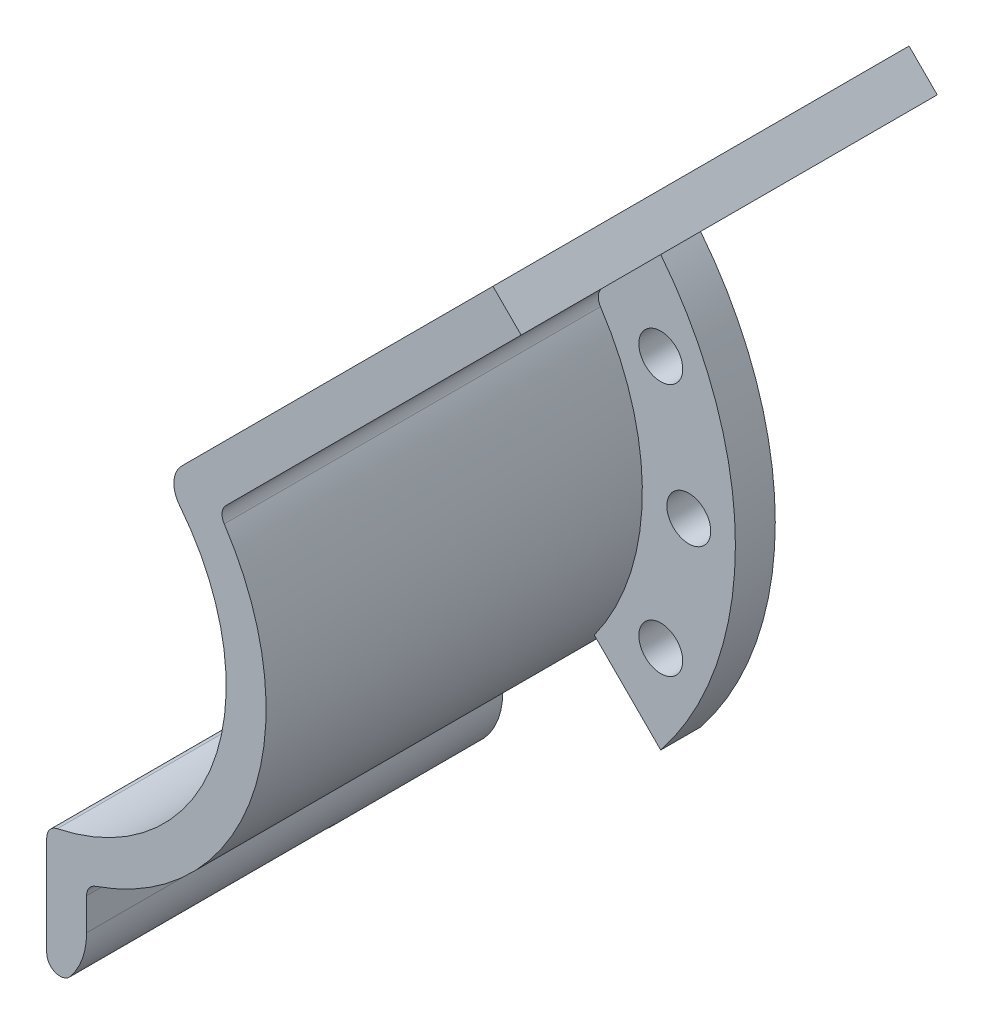
ISO-10303-21;
HEADER;
FILE_DESCRIPTION(('STEP AP214'),'2;1');
FILE_NAME('part.step','',(''),(''),'','','');
FILE_SCHEMA(('AUTOMOTIVE_DESIGN { 1 0 10303 214 1 1 1 1 }'));
ENDSEC;
DATA;
#1=APPLICATION_CONTEXT('core data for automotive mechanical design processes');
#2=APPLICATION_PROTOCOL_DEFINITION('international standard','automotive_design',2000,#1);
#3=PRODUCT_CONTEXT('',#1,'mechanical');
#4=PRODUCT('Part','Part','',(#3));
#5=PRODUCT_RELATED_PRODUCT_CATEGORY('part','',(#4));
#6=PRODUCT_DEFINITION_FORMATION('','',#4);
#7=PRODUCT_DEFINITION_CONTEXT('part definition',#1,'design');
#8=PRODUCT_DEFINITION('design','',#6,#7);
#9=PRODUCT_DEFINITION_SHAPE('','',#8);
#10=(LENGTH_UNIT() NAMED_UNIT(*) SI_UNIT(.MILLI.,.METRE.));
#11=(NAMED_UNIT(*) PLANE_ANGLE_UNIT() SI_UNIT($,.RADIAN.));
#12=(NAMED_UNIT(*) SI_UNIT($,.STERADIAN.) SOLID_ANGLE_UNIT());
#13=UNCERTAINTY_MEASURE_WITH_UNIT(LENGTH_MEASURE(1.E-05),#10,'distance_accuracy_value','');
#14=(GEOMETRIC_REPRESENTATION_CONTEXT(3) GLOBAL_UNCERTAINTY_ASSIGNED_CONTEXT((#13)) GLOBAL_UNIT_ASSIGNED_CONTEXT((#10,
#11,#12)) REPRESENTATION_CONTEXT('',''));
#15=CARTESIAN_POINT('',(0.,0.,0.));
#16=DIRECTION('',(0.,0.,1.));
#17=DIRECTION('',(1.,0.,0.));
#18=AXIS2_PLACEMENT_3D('',#15,#16,#17);
#19=CARTESIAN_POINT('',(0.,-21.3348082018374,40.2490319383578));
#20=DIRECTION('',(0.,0.,-1.));
#21=DIRECTION('',(-1.,0.,0.));
#22=AXIS2_PLACEMENT_3D('',#19,#20,#21);
#23=CYLINDRICAL_SURFACE('',#22,2.49999999999986);
#24=CARTESIAN_POINT('',(0.,-21.3348082018374,10.));
#25=DIRECTION('',(0.,0.,1.));
#26=DIRECTION('',(1.,0.,0.));
#27=AXIS2_PLACEMENT_3D('',#24,#25,#26);
#28=CIRCLE('',#27,2.49999999999986);
#29=CARTESIAN_POINT('',(2.49999999999986,-21.3348082018374,10.));
#30=VERTEX_POINT('',#29);
#31=CARTESIAN_POINT('',(0.,-23.8348082018372,10.));
#32=VERTEX_POINT('',#31);
#33=EDGE_CURVE('E165',#30,#32,#28,.F.);
#34=ORIENTED_EDGE('',*,*,#33,.F.);
#35=DIRECTION('',(0.,0.,-1.));
#36=VECTOR('',#35,1.);
#37=CARTESIAN_POINT('',(2.49999999999986,-21.3348082018374,40.2490319383578));
#38=LINE('',#37,#36);
#39=CARTESIAN_POINT('',(2.49999999999986,-21.3348082018374,-1.3));
#40=VERTEX_POINT('',#39);
#41=EDGE_CURVE('E179',#30,#40,#38,.T.);
#42=ORIENTED_EDGE('',*,*,#41,.T.);
#43=CARTESIAN_POINT('',(0.,-21.3348082018374,-1.3));
#44=DIRECTION('',(0.,0.,-1.));
#45=DIRECTION('',(-1.,0.,0.));
#46=AXIS2_PLACEMENT_3D('',#43,#44,#45);
#47=CIRCLE('',#46,2.49999999999986);
#48=CARTESIAN_POINT('',(0.,-23.8348082018372,-1.3));
#49=VERTEX_POINT('',#48);
#50=EDGE_CURVE('E187',#40,#49,#47,.T.);
#51=ORIENTED_EDGE('',*,*,#50,.T.);
#52=DIRECTION('',(0.,0.,-1.));
#53=VECTOR('',#52,1.);
#54=CARTESIAN_POINT('',(0.,-23.8348082018372,40.2490319383578));
#55=LINE('',#54,#53);
#56=EDGE_CURVE('E181',#32,#49,#55,.T.);
#57=ORIENTED_EDGE('',*,*,#56,.F.);
#58=EDGE_LOOP('',(#34,#42,#51,#57));
#59=FACE_BOUND('',#58,.T.);
#60=ADVANCED_FACE('F33',(#59),#23,.F.);
#61=CARTESIAN_POINT('',(0.,-23.8348082018372,40.2490319383578));
#62=DIRECTION('',(1.,0.,0.));
#63=DIRECTION('',(0.,1.,0.));
#64=AXIS2_PLACEMENT_3D('',#61,#62,#63);
#65=PLANE('',#64);
#66=DIRECTION('',(0.,-1.,0.));
#67=VECTOR('',#66,1.);
#68=CARTESIAN_POINT('',(0.,-23.8348082018372,10.));
#69=LINE('',#68,#67);
#70=CARTESIAN_POINT('',(0.,-26.8348082018372,10.));
#71=VERTEX_POINT('',#70);
#72=EDGE_CURVE('E172',#32,#71,#69,.T.);
#73=ORIENTED_EDGE('',*,*,#72,.F.);
#74=ORIENTED_EDGE('',*,*,#56,.T.);
#75=DIRECTION('',(0.,-1.,0.));
#76=VECTOR('',#75,1.);
#77=CARTESIAN_POINT('',(0.,-23.8348082018372,-1.3));
#78=LINE('',#77,#76);
#79=CARTESIAN_POINT('',(0.,-26.8348082018372,-1.3));
#80=VERTEX_POINT('',#79);
#81=EDGE_CURVE('E195',#49,#80,#78,.T.);
#82=ORIENTED_EDGE('',*,*,#81,.T.);
#83=DIRECTION('',(0.,0.,-1.));
#84=VECTOR('',#83,1.);
#85=CARTESIAN_POINT('',(0.,-26.8348082018372,40.2490319383578));
#86=LINE('',#85,#84);
#87=EDGE_CURVE('E196',#71,#80,#86,.T.);
#88=ORIENTED_EDGE('',*,*,#87,.F.);
#89=EDGE_LOOP('',(#73,#74,#82,#88));
#90=FACE_BOUND('',#89,.T.);
#91=ADVANCED_FACE('F403',(#90),#65,.F.);
#92=CARTESIAN_POINT('',(0.,0.,95.4754890815647));
#93=DIRECTION('',(0.,0.,-1.));
#94=DIRECTION('',(-1.,0.,0.));
#95=AXIS2_PLACEMENT_3D('',#92,#93,#94);
#96=CYLINDRICAL_SURFACE('',#95,19.);
#97=CARTESIAN_POINT('',(0.,0.,30.));
#98=DIRECTION('',(0.,0.,1.));
#99=DIRECTION('',(1.,0.,0.));
#100=AXIS2_PLACEMENT_3D('',#97,#98,#99);
#101=CIRCLE('',#100,19.);
#102=CARTESIAN_POINT('',(6.17499999999986,-17.9685663034089,30.));
#103=VERTEX_POINT('',#102);
#104=CARTESIAN_POINT('',(15.8505919060323,10.4765803690146,30.));
#105=VERTEX_POINT('',#104);
#106=EDGE_CURVE('E241',#103,#105,#101,.T.);
#107=ORIENTED_EDGE('',*,*,#106,.F.);
#108=DIRECTION('',(0.,0.,-1.));
#109=VECTOR('',#108,1.);
#110=CARTESIAN_POINT('',(6.17499999999986,-17.9685663034089,95.4754890815647));
#111=LINE('',#110,#109);
#112=CARTESIAN_POINT('',(6.17499999999986,-17.9685663034089,-1.3));
#113=VERTEX_POINT('',#112);
#114=EDGE_CURVE('E273',#103,#113,#111,.T.);
#115=ORIENTED_EDGE('',*,*,#114,.T.);
#116=CARTESIAN_POINT('',(0.,0.,-1.3));
#117=DIRECTION('',(0.,0.,1.));
#118=DIRECTION('',(1.,0.,0.));
#119=AXIS2_PLACEMENT_3D('',#116,#117,#118);
#120=CIRCLE('',#119,19.);
#121=CARTESIAN_POINT('',(15.3878195049812,-11.145178817862,-1.3));
#122=VERTEX_POINT('',#121);
#123=EDGE_CURVE('E230',#113,#122,#120,.T.);
#124=ORIENTED_EDGE('',*,*,#123,.T.);
#125=DIRECTION('',(0.,0.,-1.));
#126=VECTOR('',#125,1.);
#127=CARTESIAN_POINT('',(15.3878195049812,-11.145178817862,1.7));
#128=LINE('',#127,#126);
#129=CARTESIAN_POINT('',(15.3878195049812,-11.145178817862,1.70000000000001));
#130=VERTEX_POINT('',#129);
#131=EDGE_CURVE('E221',#130,#122,#128,.T.);
#132=ORIENTED_EDGE('',*,*,#131,.F.);
#133=CARTESIAN_POINT('',(0.,0.,1.7));
#134=DIRECTION('',(0.,0.,-1.));
#135=DIRECTION('',(1.,0.,0.));
#136=AXIS2_PLACEMENT_3D('',#133,#134,#135);
#137=CIRCLE('',#136,19.);
#138=CARTESIAN_POINT('',(15.8505919060323,10.4765803690146,1.7));
#139=VERTEX_POINT('',#138);
#140=EDGE_CURVE('E209',#139,#130,#137,.T.);
#141=ORIENTED_EDGE('',*,*,#140,.F.);
#142=DIRECTION('',(0.,0.,-1.));
#143=VECTOR('',#142,1.);
#144=CARTESIAN_POINT('',(15.8505919060323,10.4765803690146,95.4754890815647));
#145=LINE('',#144,#143);
#146=EDGE_CURVE('E271',#139,#105,#145,.F.);
#147=ORIENTED_EDGE('',*,*,#146,.T.);
#148=EDGE_LOOP('',(#107,#115,#124,#132,#141,#147));
#149=FACE_BOUND('',#148,.T.);
#150=ADVANCED_FACE('F377',(#149),#96,.T.);
#151=CARTESIAN_POINT('',(38.1837661840735,33.9411254969544,95.4754890815647));
#152=DIRECTION('',(-0.707106781186549,0.707106781186546,0.));
#153=DIRECTION('',(-0.707106781186546,-0.707106781186549,0.));
#154=AXIS2_PLACEMENT_3D('',#151,#152,#153);
#155=PLANE('',#154);
#156=DIRECTION('',(0.707106781186546,0.707106781186549,0.));
#157=VECTOR('',#156,1.);
#158=CARTESIAN_POINT('',(38.1837661840735,33.9411254969544,30.));
#159=LINE('',#158,#157);
#160=CARTESIAN_POINT('',(15.9777268041106,11.7350861169914,30.));
#161=VERTEX_POINT('',#160);
#162=CARTESIAN_POINT('',(38.1837661840735,33.9411254969544,30.));
#163=VERTEX_POINT('',#162);
#164=EDGE_CURVE('E229',#161,#163,#159,.T.);
#165=ORIENTED_EDGE('',*,*,#164,.F.);
#166=DIRECTION('',(0.,0.,1.));
#167=VECTOR('',#166,1.);
#168=CARTESIAN_POINT('',(15.9777268041106,11.7350861169914,1.70000000000006));
#169=LINE('',#168,#167);
#170=CARTESIAN_POINT('',(15.9777268041106,11.7350861169914,1.7));
#171=VERTEX_POINT('',#170);
#172=EDGE_CURVE('E284',#161,#171,#169,.F.);
#173=ORIENTED_EDGE('',*,*,#172,.T.);
#174=DIRECTION('',(-0.707106781186547,-0.707106781186548,0.));
#175=VECTOR('',#174,1.);
#176=CARTESIAN_POINT('',(15.3878195049812,11.145178817862,1.7));
#177=LINE('',#176,#175);
#178=CARTESIAN_POINT('',(20.3833027113093,16.1406620241901,1.70000000000001));
#179=VERTEX_POINT('',#178);
#180=EDGE_CURVE('E205',#179,#171,#177,.T.);
#181=ORIENTED_EDGE('',*,*,#180,.F.);
#182=DIRECTION('',(0.,0.,-1.));
#183=VECTOR('',#182,1.);
#184=CARTESIAN_POINT('',(20.3833027113093,16.1406620241901,1.7));
#185=LINE('',#184,#183);
#186=CARTESIAN_POINT('',(20.3833027113093,16.1406620241901,-1.3));
#187=VERTEX_POINT('',#186);
#188=EDGE_CURVE('E224',#179,#187,#185,.T.);
#189=ORIENTED_EDGE('',*,*,#188,.T.);
#190=DIRECTION('',(0.707106781186546,0.707106781186549,0.));
#191=VECTOR('',#190,1.);
#192=CARTESIAN_POINT('',(38.1837661840735,33.9411254969544,-1.3));
#193=LINE('',#192,#191);
#194=CARTESIAN_POINT('',(38.1837661840735,33.9411254969544,-1.3));
#195=VERTEX_POINT('',#194);
#196=EDGE_CURVE('E227',#187,#195,#193,.T.);
#197=ORIENTED_EDGE('',*,*,#196,.T.);
#198=DIRECTION('',(0.,0.,-1.));
#199=VECTOR('',#198,1.);
#200=CARTESIAN_POINT('',(38.1837661840735,33.9411254969544,95.4754890815647));
#201=LINE('',#200,#199);
#202=EDGE_CURVE('E226',#163,#195,#201,.T.);
#203=ORIENTED_EDGE('',*,*,#202,.F.);
#204=EDGE_LOOP('',(#165,#173,#181,#189,#197,#203));
#205=FACE_BOUND('',#204,.T.);
#206=ADVANCED_FACE('F367',(#205),#155,.F.);
#207=CARTESIAN_POINT('',(36.0624458405138,36.062445840514,95.4754890815647));
#208=DIRECTION('',(-0.707106781186544,-0.707106781186551,0.));
#209=DIRECTION('',(0.707106781186551,-0.707106781186544,0.));
#210=AXIS2_PLACEMENT_3D('',#207,#208,#209);
#211=PLANE('',#210);
#212=DIRECTION('',(-0.707106781186551,0.707106781186544,0.));
#213=VECTOR('',#212,1.);
#214=CARTESIAN_POINT('',(36.0624458405138,36.062445840514,30.));
#215=LINE('',#214,#213);
#216=CARTESIAN_POINT('',(36.0624458405138,36.062445840514,30.));
#217=VERTEX_POINT('',#216);
#218=EDGE_CURVE('E252',#163,#217,#215,.T.);
#219=ORIENTED_EDGE('',*,*,#218,.F.);
#220=ORIENTED_EDGE('',*,*,#202,.T.);
#221=DIRECTION('',(-0.707106781186551,0.707106781186544,0.));
#222=VECTOR('',#221,1.);
#223=CARTESIAN_POINT('',(36.0624458405138,36.062445840514,-1.3));
#224=LINE('',#223,#222);
#225=CARTESIAN_POINT('',(36.0624458405138,36.062445840514,-1.3));
#226=VERTEX_POINT('',#225);
#227=EDGE_CURVE('E238',#195,#226,#224,.T.);
#228=ORIENTED_EDGE('',*,*,#227,.T.);
#229=DIRECTION('',(0.,0.,-1.));
#230=VECTOR('',#229,1.);
#231=CARTESIAN_POINT('',(36.0624458405138,36.062445840514,95.4754890815647));
#232=LINE('',#231,#230);
#233=EDGE_CURVE('E237',#217,#226,#232,.T.);
#234=ORIENTED_EDGE('',*,*,#233,.F.);
#235=EDGE_LOOP('',(#219,#220,#228,#234));
#236=FACE_BOUND('',#235,.T.);
#237=ADVANCED_FACE('F449',(#236),#211,.F.);
#238=CARTESIAN_POINT('',(36.0624458405138,36.062445840514,95.4754890815647));
#239=DIRECTION('',(0.707106781186549,-0.707106781186546,0.));
#240=DIRECTION('',(0.707106781186546,0.707106781186549,0.));
#241=AXIS2_PLACEMENT_3D('',#238,#239,#240);
#242=PLANE('',#241);
#243=DIRECTION('',(-0.707106781186546,-0.707106781186549,0.));
#244=VECTOR('',#243,1.);
#245=CARTESIAN_POINT('',(36.0624458405138,36.062445840514,-1.3));
#246=LINE('',#245,#244);
#247=CARTESIAN_POINT('',(12.6491106406735,12.6491106406735,-1.3));
#248=VERTEX_POINT('',#247);
#249=EDGE_CURVE('E235',#226,#248,#246,.T.);
#250=ORIENTED_EDGE('',*,*,#249,.T.);
#251=DIRECTION('',(0.,0.,-1.));
#252=VECTOR('',#251,1.);
#253=CARTESIAN_POINT('',(12.6491106406735,12.6491106406735,95.4754890815647));
#254=LINE('',#253,#252);
#255=CARTESIAN_POINT('',(12.6491106406735,12.6491106406735,30.));
#256=VERTEX_POINT('',#255);
#257=EDGE_CURVE('E41',#248,#256,#254,.F.);
#258=ORIENTED_EDGE('',*,*,#257,.T.);
#259=DIRECTION('',(-0.707106781186546,-0.707106781186549,0.));
#260=VECTOR('',#259,1.);
#261=CARTESIAN_POINT('',(36.0624458405138,36.062445840514,30.));
#262=LINE('',#261,#260);
#263=EDGE_CURVE('E250',#217,#256,#262,.T.);
#264=ORIENTED_EDGE('',*,*,#263,.F.);
#265=ORIENTED_EDGE('',*,*,#233,.T.);
#266=EDGE_LOOP('',(#250,#258,#264,#265));
#267=FACE_BOUND('',#266,.T.);
#268=ADVANCED_FACE('F454',(#267),#242,.F.);
#269=CARTESIAN_POINT('',(0.,0.,95.4754890815647));
#270=DIRECTION('',(0.,0.,-1.));
#271=DIRECTION('',(-1.,0.,0.));
#272=AXIS2_PLACEMENT_3D('',#269,#270,#271);
#273=CYLINDRICAL_SURFACE('',#272,16.);
#274=CARTESIAN_POINT('',(0.,0.,30.));
#275=DIRECTION('',(0.,0.,1.));
#276=DIRECTION('',(1.,0.,0.));
#277=AXIS2_PLACEMENT_3D('',#274,#275,#276);
#278=CIRCLE('',#277,16.);
#279=CARTESIAN_POINT('',(12.5007326249303,9.98657518071152,30.));
#280=VERTEX_POINT('',#279);
#281=CARTESIAN_POINT('',(3.29411764705869,-15.6572280090486,30.));
#282=VERTEX_POINT('',#281);
#283=EDGE_CURVE('E248',#280,#282,#278,.F.);
#284=ORIENTED_EDGE('',*,*,#283,.F.);
#285=DIRECTION('',(0.,0.,-1.));
#286=VECTOR('',#285,1.);
#287=CARTESIAN_POINT('',(12.5007326249303,9.98657518071152,95.4754890815647));
#288=LINE('',#287,#286);
#289=CARTESIAN_POINT('',(12.5007326249303,9.98657518071152,-1.3));
#290=VERTEX_POINT('',#289);
#291=EDGE_CURVE('E296',#280,#290,#288,.T.);
#292=ORIENTED_EDGE('',*,*,#291,.T.);
#293=CARTESIAN_POINT('',(0.,0.,-1.3));
#294=DIRECTION('',(0.,0.,-1.));
#295=DIRECTION('',(1.,0.,0.));
#296=AXIS2_PLACEMENT_3D('',#293,#294,#295);
#297=CIRCLE('',#296,16.);
#298=CARTESIAN_POINT('',(3.29411764705869,-15.6572280090486,-1.3));
#299=VERTEX_POINT('',#298);
#300=EDGE_CURVE('E233',#290,#299,#297,.T.);
#301=ORIENTED_EDGE('',*,*,#300,.T.);
#302=DIRECTION('',(0.,0.,-1.));
#303=VECTOR('',#302,1.);
#304=CARTESIAN_POINT('',(3.29411764705869,-15.6572280090486,95.4754890815647));
#305=LINE('',#304,#303);
#306=EDGE_CURVE('E281',#299,#282,#305,.F.);
#307=ORIENTED_EDGE('',*,*,#306,.T.);
#308=EDGE_LOOP('',(#284,#292,#301,#307));
#309=FACE_BOUND('',#308,.T.);
#310=ADVANCED_FACE('F302',(#309),#273,.F.);
#311=CARTESIAN_POINT('',(2.49999999999986,-15.8034806292791,95.4754890815647));
#312=DIRECTION('',(1.,0.,0.));
#313=DIRECTION('',(0.,0.,-1.));
#314=AXIS2_PLACEMENT_3D('',#311,#312,#313);
#315=PLANE('',#314);
#316=DIRECTION('',(0.,1.,0.));
#317=VECTOR('',#316,1.);
#318=CARTESIAN_POINT('',(2.49999999999986,-21.3348082018374,10.));
#319=LINE('',#318,#317);
#320=CARTESIAN_POINT('',(2.49999999999986,-24.1632353265835,10.));
#321=VERTEX_POINT('',#320);
#322=EDGE_CURVE('E162',#321,#30,#319,.T.);
#323=ORIENTED_EDGE('',*,*,#322,.F.);
#324=DIRECTION('',(0.,0.,-1.));
#325=VECTOR('',#324,1.);
#326=CARTESIAN_POINT('',(2.49999999999986,-24.1632353265835,95.4754890815647));
#327=LINE('',#326,#325);
#328=CARTESIAN_POINT('',(2.49999999999986,-24.1632353265835,30.));
#329=VERTEX_POINT('',#328);
#330=EDGE_CURVE('E265',#321,#329,#327,.F.);
#331=ORIENTED_EDGE('',*,*,#330,.T.);
#332=DIRECTION('',(0.,-1.,0.));
#333=VECTOR('',#332,1.);
#334=CARTESIAN_POINT('',(2.49999999999986,-15.8034806292791,30.));
#335=LINE('',#334,#333);
#336=CARTESIAN_POINT('',(2.49999999999986,-16.6358047596142,30.));
#337=VERTEX_POINT('',#336);
#338=EDGE_CURVE('E245',#337,#329,#335,.T.);
#339=ORIENTED_EDGE('',*,*,#338,.F.);
#340=DIRECTION('',(0.,0.,-1.));
#341=VECTOR('',#340,1.);
#342=CARTESIAN_POINT('',(2.49999999999986,-16.6358047596142,95.4754890815647));
#343=LINE('',#342,#341);
#344=CARTESIAN_POINT('',(2.49999999999986,-16.6358047596142,-1.3));
#345=VERTEX_POINT('',#344);
#346=EDGE_CURVE('E263',#337,#345,#343,.T.);
#347=ORIENTED_EDGE('',*,*,#346,.T.);
#348=DIRECTION('',(0.,-1.,0.));
#349=VECTOR('',#348,1.);
#350=CARTESIAN_POINT('',(2.49999999999986,-15.8034806292791,-1.3));
#351=LINE('',#350,#349);
#352=EDGE_CURVE('E186',#345,#40,#351,.T.);
#353=ORIENTED_EDGE('',*,*,#352,.T.);
#354=ORIENTED_EDGE('',*,*,#41,.F.);
#355=EDGE_LOOP('',(#323,#331,#339,#347,#353,#354));
#356=FACE_BOUND('',#355,.T.);
#357=ADVANCED_FACE('F183',(#356),#315,.F.);
#358=CARTESIAN_POINT('',(0.,0.,-1.3));
#359=DIRECTION('',(0.,0.,1.));
#360=DIRECTION('',(1.,0.,0.));
#361=AXIS2_PLACEMENT_3D('',#358,#359,#360);
#362=PLANE('',#361);
#363=CARTESIAN_POINT('',(22.4949455159964,0.,-1.3));
#364=DIRECTION('',(0.,0.,1.));
#365=DIRECTION('',(1.,0.,0.));
#366=AXIS2_PLACEMENT_3D('',#363,#364,#365);
#367=CIRCLE('',#366,1.65);
#368=CARTESIAN_POINT('',(24.1449455159964,0.,-1.3));
#369=VERTEX_POINT('',#368);
#370=EDGE_CURVE('E344',#369,#369,#367,.T.);
#371=ORIENTED_EDGE('',*,*,#370,.T.);
#372=EDGE_LOOP('',(#371));
#373=FACE_BOUND('',#372,.T.);
#374=CARTESIAN_POINT('',(20.3873442901127,9.50677477192217,-1.3));
#375=DIRECTION('',(0.,0.,1.));
#376=DIRECTION('',(1.,0.,0.));
#377=AXIS2_PLACEMENT_3D('',#374,#375,#376);
#378=CIRCLE('',#377,1.65);
#379=CARTESIAN_POINT('',(22.0373442901127,9.50677477192217,-1.3));
#380=VERTEX_POINT('',#379);
#381=EDGE_CURVE('E338',#380,#380,#378,.T.);
#382=ORIENTED_EDGE('',*,*,#381,.T.);
#383=EDGE_LOOP('',(#382));
#384=FACE_BOUND('',#383,.T.);
#385=CARTESIAN_POINT('',(20.3873442901127,-9.50677477192216,-1.3));
#386=DIRECTION('',(0.,0.,1.));
#387=DIRECTION('',(1.,0.,0.));
#388=AXIS2_PLACEMENT_3D('',#385,#386,#387);
#389=CIRCLE('',#388,1.65);
#390=CARTESIAN_POINT('',(22.0373442901127,-9.50677477192216,-1.3));
#391=VERTEX_POINT('',#390);
#392=EDGE_CURVE('E173',#391,#391,#389,.T.);
#393=ORIENTED_EDGE('',*,*,#392,.T.);
#394=EDGE_LOOP('',(#393));
#395=FACE_BOUND('',#394,.T.);
#396=ORIENTED_EDGE('',*,*,#300,.F.);
#397=CARTESIAN_POINT('',(14.0633242030466,11.2348970783005,-1.3));
#398=DIRECTION('',(0.,0.,1.));
#399=DIRECTION('',(1.,0.,0.));
#400=AXIS2_PLACEMENT_3D('',#397,#398,#399);
#401=CIRCLE('',#400,2.);
#402=EDGE_CURVE('E55',#290,#248,#401,.F.);
#403=ORIENTED_EDGE('',*,*,#402,.T.);
#404=ORIENTED_EDGE('',*,*,#249,.F.);
#405=ORIENTED_EDGE('',*,*,#227,.F.);
#406=ORIENTED_EDGE('',*,*,#196,.F.);
#407=CARTESIAN_POINT('',(0.,0.,-1.3));
#408=DIRECTION('',(0.,0.,1.));
#409=DIRECTION('',(-1.,0.,0.));
#410=AXIS2_PLACEMENT_3D('',#407,#408,#409);
#411=CIRCLE('',#410,26.);
#412=CARTESIAN_POINT('',(20.3833027113093,-16.1406620241901,-1.3));
#413=VERTEX_POINT('',#412);
#414=EDGE_CURVE('E214',#413,#187,#411,.T.);
#415=ORIENTED_EDGE('',*,*,#414,.F.);
#416=DIRECTION('',(0.707106781186547,-0.707106781186548,0.));
#417=VECTOR('',#416,1.);
#418=CARTESIAN_POINT('',(15.3878195049812,-11.145178817862,-1.3));
#419=LINE('',#418,#417);
#420=EDGE_CURVE('E206',#122,#413,#419,.T.);
#421=ORIENTED_EDGE('',*,*,#420,.F.);
#422=ORIENTED_EDGE('',*,*,#123,.F.);
#423=CARTESIAN_POINT('',(6.49999999999986,-18.9142803193778,-1.3));
#424=DIRECTION('',(0.,0.,1.));
#425=DIRECTION('',(1.,0.,0.));
#426=AXIS2_PLACEMENT_3D('',#423,#424,#425);
#427=CIRCLE('',#426,1.);
#428=CARTESIAN_POINT('',(5.49999999999986,-18.9142803193778,-1.3));
#429=VERTEX_POINT('',#428);
#430=EDGE_CURVE('E290',#113,#429,#427,.T.);
#431=ORIENTED_EDGE('',*,*,#430,.T.);
#432=DIRECTION('',(0.,1.,0.));
#433=VECTOR('',#432,1.);
#434=CARTESIAN_POINT('',(5.49999999999986,-21.3348082018374,-1.3));
#435=LINE('',#434,#433);
#436=CARTESIAN_POINT('',(5.49999999999986,-21.3348082018374,-1.3));
#437=VERTEX_POINT('',#436);
#438=EDGE_CURVE('E201',#437,#429,#435,.T.);
#439=ORIENTED_EDGE('',*,*,#438,.F.);
#440=CARTESIAN_POINT('',(0.,-21.3348082018374,-1.3));
#441=DIRECTION('',(0.,0.,1.));
#442=DIRECTION('',(1.,0.,0.));
#443=AXIS2_PLACEMENT_3D('',#440,#441,#442);
#444=CIRCLE('',#443,5.49999999999986);
#445=EDGE_CURVE('E198',#80,#437,#444,.T.);
#446=ORIENTED_EDGE('',*,*,#445,.F.);
#447=ORIENTED_EDGE('',*,*,#81,.F.);
#448=ORIENTED_EDGE('',*,*,#50,.F.);
#449=ORIENTED_EDGE('',*,*,#352,.F.);
#450=CARTESIAN_POINT('',(3.49999999999986,-16.6358047596142,-1.3));
#451=DIRECTION('',(0.,0.,1.));
#452=DIRECTION('',(1.,0.,0.));
#453=AXIS2_PLACEMENT_3D('',#450,#451,#452);
#454=CIRCLE('',#453,1.);
#455=EDGE_CURVE('E278',#345,#299,#454,.F.);
#456=ORIENTED_EDGE('',*,*,#455,.T.);
#457=EDGE_LOOP('',(#396,#403,#404,#405,#406,#415,#421,#422,#431,#439,#446,#447,#448,#449,#456));
#458=FACE_BOUND('',#457,.T.);
#459=ADVANCED_FACE('F305',(#373,#384,#395,#458),#362,.F.);
#460=CARTESIAN_POINT('',(-13.5,0.,30.));
#461=DIRECTION('',(0.,0.,1.));
#462=DIRECTION('',(1.,0.,0.));
#463=AXIS2_PLACEMENT_3D('',#460,#461,#462);
#464=PLANE('',#463);
#465=ORIENTED_EDGE('',*,*,#263,.T.);
#466=CARTESIAN_POINT('',(14.0633242030466,11.2348970783005,30.));
#467=DIRECTION('',(0.,0.,1.));
#468=DIRECTION('',(1.,0.,0.));
#469=AXIS2_PLACEMENT_3D('',#466,#467,#468);
#470=CIRCLE('',#469,2.);
#471=EDGE_CURVE('E11',#256,#280,#470,.T.);
#472=ORIENTED_EDGE('',*,*,#471,.T.);
#473=ORIENTED_EDGE('',*,*,#283,.T.);
#474=CARTESIAN_POINT('',(3.49999999999986,-16.6358047596142,30.));
#475=DIRECTION('',(0.,0.,1.));
#476=DIRECTION('',(1.,0.,0.));
#477=AXIS2_PLACEMENT_3D('',#474,#475,#476);
#478=CIRCLE('',#477,1.);
#479=EDGE_CURVE('E267',#282,#337,#478,.T.);
#480=ORIENTED_EDGE('',*,*,#479,.T.);
#481=ORIENTED_EDGE('',*,*,#338,.T.);
#482=CARTESIAN_POINT('',(3.49999999999986,-24.1632353265835,30.));
#483=DIRECTION('',(0.,0.,1.));
#484=DIRECTION('',(1.,0.,0.));
#485=AXIS2_PLACEMENT_3D('',#482,#483,#484);
#486=CIRCLE('',#485,1.);
#487=CARTESIAN_POINT('',(4.27777777777763,-24.7917746876382,30.));
#488=VERTEX_POINT('',#487);
#489=EDGE_CURVE('E269',#329,#488,#486,.T.);
#490=ORIENTED_EDGE('',*,*,#489,.T.);
#491=CARTESIAN_POINT('',(0.,-21.3348082018374,30.));
#492=DIRECTION('',(0.,0.,1.));
#493=DIRECTION('',(1.,0.,0.));
#494=AXIS2_PLACEMENT_3D('',#491,#492,#493);
#495=CIRCLE('',#494,5.49999999999986);
#496=CARTESIAN_POINT('',(5.49999999999986,-21.3348082018374,30.));
#497=VERTEX_POINT('',#496);
#498=EDGE_CURVE('E217',#488,#497,#495,.T.);
#499=ORIENTED_EDGE('',*,*,#498,.T.);
#500=DIRECTION('',(0.,1.,0.));
#501=VECTOR('',#500,1.);
#502=CARTESIAN_POINT('',(5.49999999999986,-21.3348082018374,30.));
#503=LINE('',#502,#501);
#504=CARTESIAN_POINT('',(5.49999999999986,-18.9142803193778,30.));
#505=VERTEX_POINT('',#504);
#506=EDGE_CURVE('E192',#497,#505,#503,.T.);
#507=ORIENTED_EDGE('',*,*,#506,.T.);
#508=CARTESIAN_POINT('',(6.49999999999986,-18.9142803193778,30.));
#509=DIRECTION('',(0.,0.,1.));
#510=DIRECTION('',(1.,0.,0.));
#511=AXIS2_PLACEMENT_3D('',#508,#509,#510);
#512=CIRCLE('',#511,1.);
#513=EDGE_CURVE('E292',#505,#103,#512,.F.);
#514=ORIENTED_EDGE('',*,*,#513,.T.);
#515=ORIENTED_EDGE('',*,*,#106,.T.);
#516=CARTESIAN_POINT('',(16.6848335852972,11.0279793358049,30.));
#517=DIRECTION('',(0.,0.,1.));
#518=DIRECTION('',(1.,0.,0.));
#519=AXIS2_PLACEMENT_3D('',#516,#517,#518);
#520=CIRCLE('',#519,1.);
#521=EDGE_CURVE('E294',#105,#161,#520,.F.);
#522=ORIENTED_EDGE('',*,*,#521,.T.);
#523=ORIENTED_EDGE('',*,*,#164,.T.);
#524=ORIENTED_EDGE('',*,*,#218,.T.);
#525=EDGE_LOOP('',(#465,#472,#473,#480,#481,#490,#499,#507,#514,#515,#522,#523,#524));
#526=FACE_BOUND('',#525,.T.);
#527=ADVANCED_FACE('F313',(#526),#464,.T.);
#528=CARTESIAN_POINT('',(0.,0.,1.7));
#529=DIRECTION('',(0.,0.,-1.));
#530=DIRECTION('',(-1.,0.,0.));
#531=AXIS2_PLACEMENT_3D('',#528,#529,#530);
#532=CYLINDRICAL_SURFACE('',#531,26.);
#533=ORIENTED_EDGE('',*,*,#414,.T.);
#534=ORIENTED_EDGE('',*,*,#188,.F.);
#535=CARTESIAN_POINT('',(0.,0.,1.7));
#536=DIRECTION('',(0.,0.,1.));
#537=DIRECTION('',(-1.,0.,0.));
#538=AXIS2_PLACEMENT_3D('',#535,#536,#537);
#539=CIRCLE('',#538,26.);
#540=CARTESIAN_POINT('',(20.3833027113093,-16.1406620241901,1.7));
#541=VERTEX_POINT('',#540);
#542=EDGE_CURVE('E202',#541,#179,#539,.T.);
#543=ORIENTED_EDGE('',*,*,#542,.F.);
#544=DIRECTION('',(0.,0.,-1.));
#545=VECTOR('',#544,1.);
#546=CARTESIAN_POINT('',(20.3833027113093,-16.1406620241901,1.7));
#547=LINE('',#546,#545);
#548=EDGE_CURVE('E213',#541,#413,#547,.T.);
#549=ORIENTED_EDGE('',*,*,#548,.T.);
#550=EDGE_LOOP('',(#533,#534,#543,#549));
#551=FACE_BOUND('',#550,.T.);
#552=ADVANCED_FACE('F392',(#551),#532,.T.);
#553=CARTESIAN_POINT('',(15.3878195049812,-11.145178817862,1.7));
#554=DIRECTION('',(0.707106781186548,0.707106781186547,0.));
#555=DIRECTION('',(-0.707106781186547,0.707106781186548,0.));
#556=AXIS2_PLACEMENT_3D('',#553,#554,#555);
#557=PLANE('',#556);
#558=ORIENTED_EDGE('',*,*,#420,.T.);
#559=ORIENTED_EDGE('',*,*,#548,.F.);
#560=DIRECTION('',(0.707106781186547,-0.707106781186548,0.));
#561=VECTOR('',#560,1.);
#562=CARTESIAN_POINT('',(15.3878195049812,-11.145178817862,1.7));
#563=LINE('',#562,#561);
#564=EDGE_CURVE('E211',#130,#541,#563,.T.);
#565=ORIENTED_EDGE('',*,*,#564,.F.);
#566=ORIENTED_EDGE('',*,*,#131,.T.);
#567=EDGE_LOOP('',(#558,#559,#565,#566));
#568=FACE_BOUND('',#567,.T.);
#569=ADVANCED_FACE('F356',(#568),#557,.F.);
#570=CARTESIAN_POINT('',(0.,0.,1.7));
#571=DIRECTION('',(0.,0.,-1.));
#572=DIRECTION('',(-1.,0.,0.));
#573=AXIS2_PLACEMENT_3D('',#570,#571,#572);
#574=PLANE('',#573);
#575=CARTESIAN_POINT('',(22.4949455159964,0.,1.7));
#576=DIRECTION('',(0.,0.,1.));
#577=DIRECTION('',(1.,0.,0.));
#578=AXIS2_PLACEMENT_3D('',#575,#576,#577);
#579=CIRCLE('',#578,1.65);
#580=CARTESIAN_POINT('',(24.1449455159964,0.,1.7));
#581=VERTEX_POINT('',#580);
#582=EDGE_CURVE('E347',#581,#581,#579,.T.);
#583=ORIENTED_EDGE('',*,*,#582,.F.);
#584=EDGE_LOOP('',(#583));
#585=FACE_BOUND('',#584,.T.);
#586=CARTESIAN_POINT('',(20.3873442901127,9.50677477192217,1.7));
#587=DIRECTION('',(0.,0.,1.));
#588=DIRECTION('',(1.,0.,0.));
#589=AXIS2_PLACEMENT_3D('',#586,#587,#588);
#590=CIRCLE('',#589,1.65);
#591=CARTESIAN_POINT('',(22.0373442901127,9.50677477192217,1.7));
#592=VERTEX_POINT('',#591);
#593=EDGE_CURVE('E341',#592,#592,#590,.T.);
#594=ORIENTED_EDGE('',*,*,#593,.F.);
#595=EDGE_LOOP('',(#594));
#596=FACE_BOUND('',#595,.T.);
#597=CARTESIAN_POINT('',(20.3873442901127,-9.50677477192216,1.7));
#598=DIRECTION('',(0.,0.,1.));
#599=DIRECTION('',(1.,0.,0.));
#600=AXIS2_PLACEMENT_3D('',#597,#598,#599);
#601=CIRCLE('',#600,1.65);
#602=CARTESIAN_POINT('',(22.0373442901127,-9.50677477192216,1.7));
#603=VERTEX_POINT('',#602);
#604=EDGE_CURVE('E335',#603,#603,#601,.T.);
#605=ORIENTED_EDGE('',*,*,#604,.F.);
#606=EDGE_LOOP('',(#605));
#607=FACE_BOUND('',#606,.T.);
#608=ORIENTED_EDGE('',*,*,#180,.T.);
#609=CARTESIAN_POINT('',(16.6848335852972,11.0279793358049,1.70000000000001));
#610=DIRECTION('',(0.,0.,-1.));
#611=DIRECTION('',(-1.,0.,0.));
#612=AXIS2_PLACEMENT_3D('',#609,#610,#611);
#613=CIRCLE('',#612,1.);
#614=EDGE_CURVE('E287',#171,#139,#613,.F.);
#615=ORIENTED_EDGE('',*,*,#614,.T.);
#616=ORIENTED_EDGE('',*,*,#140,.T.);
#617=ORIENTED_EDGE('',*,*,#564,.T.);
#618=ORIENTED_EDGE('',*,*,#542,.T.);
#619=EDGE_LOOP('',(#608,#615,#616,#617,#618));
#620=FACE_BOUND('',#619,.T.);
#621=ADVANCED_FACE('F353',(#585,#596,#607,#620),#574,.F.);
#622=CARTESIAN_POINT('',(0.,-21.3348082018374,40.2490319383578));
#623=DIRECTION('',(0.,0.,-1.));
#624=DIRECTION('',(-1.,0.,0.));
#625=AXIS2_PLACEMENT_3D('',#622,#623,#624);
#626=CYLINDRICAL_SURFACE('',#625,5.49999999999986);
#627=ORIENTED_EDGE('',*,*,#498,.F.);
#628=DIRECTION('',(0.,0.,-1.));
#629=VECTOR('',#628,1.);
#630=CARTESIAN_POINT('',(4.27777777777763,-24.7917746876382,40.2490319383578));
#631=LINE('',#630,#629);
#632=CARTESIAN_POINT('',(4.27777777777763,-24.7917746876382,10.));
#633=VERTEX_POINT('',#632);
#634=EDGE_CURVE('E260',#488,#633,#631,.T.);
#635=ORIENTED_EDGE('',*,*,#634,.T.);
#636=CARTESIAN_POINT('',(0.,-21.3348082018374,10.));
#637=DIRECTION('',(0.,0.,1.));
#638=DIRECTION('',(1.,0.,0.));
#639=AXIS2_PLACEMENT_3D('',#636,#637,#638);
#640=CIRCLE('',#639,5.49999999999986);
#641=EDGE_CURVE('E244',#71,#633,#640,.T.);
#642=ORIENTED_EDGE('',*,*,#641,.F.);
#643=ORIENTED_EDGE('',*,*,#87,.T.);
#644=ORIENTED_EDGE('',*,*,#445,.T.);
#645=DIRECTION('',(0.,0.,-1.));
#646=VECTOR('',#645,1.);
#647=CARTESIAN_POINT('',(5.49999999999986,-21.3348082018374,40.2490319383578));
#648=LINE('',#647,#646);
#649=EDGE_CURVE('E199',#497,#437,#648,.T.);
#650=ORIENTED_EDGE('',*,*,#649,.F.);
#651=EDGE_LOOP('',(#627,#635,#642,#643,#644,#650));
#652=FACE_BOUND('',#651,.T.);
#653=ADVANCED_FACE('F322',(#652),#626,.T.);
#654=CARTESIAN_POINT('',(5.49999999999986,-21.3348082018374,40.2490319383578));
#655=DIRECTION('',(-1.,0.,0.));
#656=DIRECTION('',(0.,0.,1.));
#657=AXIS2_PLACEMENT_3D('',#654,#655,#656);
#658=PLANE('',#657);
#659=ORIENTED_EDGE('',*,*,#438,.T.);
#660=DIRECTION('',(0.,0.,1.));
#661=VECTOR('',#660,1.);
#662=CARTESIAN_POINT('',(5.49999999999986,-18.9142803193778,30.));
#663=LINE('',#662,#661);
#664=EDGE_CURVE('E276',#429,#505,#663,.T.);
#665=ORIENTED_EDGE('',*,*,#664,.T.);
#666=ORIENTED_EDGE('',*,*,#506,.F.);
#667=ORIENTED_EDGE('',*,*,#649,.T.);
#668=EDGE_LOOP('',(#659,#665,#666,#667));
#669=FACE_BOUND('',#668,.T.);
#670=ADVANCED_FACE('F413',(#669),#658,.F.);
#671=CARTESIAN_POINT('',(0.,0.,10.));
#672=DIRECTION('',(0.,0.,1.));
#673=DIRECTION('',(1.,0.,0.));
#674=AXIS2_PLACEMENT_3D('',#671,#672,#673);
#675=PLANE('',#674);
#676=ORIENTED_EDGE('',*,*,#33,.T.);
#677=ORIENTED_EDGE('',*,*,#72,.T.);
#678=ORIENTED_EDGE('',*,*,#641,.T.);
#679=CARTESIAN_POINT('',(3.49999999999986,-24.1632353265835,10.));
#680=DIRECTION('',(0.,0.,1.));
#681=DIRECTION('',(1.,0.,0.));
#682=AXIS2_PLACEMENT_3D('',#679,#680,#681);
#683=CIRCLE('',#682,1.);
#684=EDGE_CURVE('E168',#633,#321,#683,.F.);
#685=ORIENTED_EDGE('',*,*,#684,.T.);
#686=ORIENTED_EDGE('',*,*,#322,.T.);
#687=EDGE_LOOP('',(#676,#677,#678,#685,#686));
#688=FACE_BOUND('',#687,.T.);
#689=ADVANCED_FACE('F164',(#688),#675,.T.);
#690=CARTESIAN_POINT('',(20.3873442901127,-9.50677477192216,1.7));
#691=DIRECTION('',(0.,0.,1.));
#692=DIRECTION('',(1.,0.,0.));
#693=AXIS2_PLACEMENT_3D('',#690,#691,#692);
#694=CYLINDRICAL_SURFACE('',#693,1.65);
#695=ORIENTED_EDGE('',*,*,#392,.F.);
#696=EDGE_LOOP('',(#695));
#697=FACE_BOUND('',#696,.T.);
#698=ORIENTED_EDGE('',*,*,#604,.T.);
#699=EDGE_LOOP('',(#698));
#700=FACE_BOUND('',#699,.T.);
#701=ADVANCED_FACE('F419',(#697,#700),#694,.F.);
#702=CARTESIAN_POINT('',(20.3873442901127,9.50677477192217,1.7));
#703=DIRECTION('',(0.,0.,1.));
#704=DIRECTION('',(1.,0.,0.));
#705=AXIS2_PLACEMENT_3D('',#702,#703,#704);
#706=CYLINDRICAL_SURFACE('',#705,1.65);
#707=ORIENTED_EDGE('',*,*,#381,.F.);
#708=EDGE_LOOP('',(#707));
#709=FACE_BOUND('',#708,.T.);
#710=ORIENTED_EDGE('',*,*,#593,.T.);
#711=EDGE_LOOP('',(#710));
#712=FACE_BOUND('',#711,.T.);
#713=ADVANCED_FACE('F422',(#709,#712),#706,.F.);
#714=CARTESIAN_POINT('',(22.4949455159964,0.,1.7));
#715=DIRECTION('',(0.,0.,1.));
#716=DIRECTION('',(1.,0.,0.));
#717=AXIS2_PLACEMENT_3D('',#714,#715,#716);
#718=CYLINDRICAL_SURFACE('',#717,1.65);
#719=ORIENTED_EDGE('',*,*,#370,.F.);
#720=EDGE_LOOP('',(#719));
#721=FACE_BOUND('',#720,.T.);
#722=ORIENTED_EDGE('',*,*,#582,.T.);
#723=EDGE_LOOP('',(#722));
#724=FACE_BOUND('',#723,.T.);
#725=ADVANCED_FACE('F351',(#721,#724),#718,.F.);
#726=CARTESIAN_POINT('',(3.49999999999986,-24.1632353265835,40.2490319383578));
#727=DIRECTION('',(0.,0.,-1.));
#728=DIRECTION('',(-1.,0.,0.));
#729=AXIS2_PLACEMENT_3D('',#726,#727,#728);
#730=CYLINDRICAL_SURFACE('',#729,1.);
#731=ORIENTED_EDGE('',*,*,#489,.F.);
#732=ORIENTED_EDGE('',*,*,#330,.F.);
#733=ORIENTED_EDGE('',*,*,#684,.F.);
#734=ORIENTED_EDGE('',*,*,#634,.F.);
#735=EDGE_LOOP('',(#731,#732,#733,#734));
#736=FACE_BOUND('',#735,.T.);
#737=ADVANCED_FACE('F316',(#736),#730,.T.);
#738=CARTESIAN_POINT('',(6.49999999999986,-18.9142803193778,95.4754890815647));
#739=DIRECTION('',(0.,0.,-1.));
#740=DIRECTION('',(-1.,0.,0.));
#741=AXIS2_PLACEMENT_3D('',#738,#739,#740);
#742=CYLINDRICAL_SURFACE('',#741,1.);
#743=ORIENTED_EDGE('',*,*,#513,.F.);
#744=ORIENTED_EDGE('',*,*,#664,.F.);
#745=ORIENTED_EDGE('',*,*,#430,.F.);
#746=ORIENTED_EDGE('',*,*,#114,.F.);
#747=EDGE_LOOP('',(#743,#744,#745,#746));
#748=FACE_BOUND('',#747,.T.);
#749=ADVANCED_FACE('F383',(#748),#742,.F.);
#750=CARTESIAN_POINT('',(3.49999999999986,-16.6358047596142,95.4754890815647));
#751=DIRECTION('',(0.,0.,-1.));
#752=DIRECTION('',(-1.,0.,0.));
#753=AXIS2_PLACEMENT_3D('',#750,#751,#752);
#754=CYLINDRICAL_SURFACE('',#753,1.);
#755=ORIENTED_EDGE('',*,*,#479,.F.);
#756=ORIENTED_EDGE('',*,*,#306,.F.);
#757=ORIENTED_EDGE('',*,*,#455,.F.);
#758=ORIENTED_EDGE('',*,*,#346,.F.);
#759=EDGE_LOOP('',(#755,#756,#757,#758));
#760=FACE_BOUND('',#759,.T.);
#761=ADVANCED_FACE('F310',(#760),#754,.T.);
#762=CARTESIAN_POINT('',(16.6848335852972,11.0279793358049,95.4754890815647));
#763=DIRECTION('',(0.,0.,-1.));
#764=DIRECTION('',(-1.,0.,0.));
#765=AXIS2_PLACEMENT_3D('',#762,#763,#764);
#766=CYLINDRICAL_SURFACE('',#765,1.);
#767=ORIENTED_EDGE('',*,*,#521,.F.);
#768=ORIENTED_EDGE('',*,*,#146,.F.);
#769=ORIENTED_EDGE('',*,*,#614,.F.);
#770=ORIENTED_EDGE('',*,*,#172,.F.);
#771=EDGE_LOOP('',(#767,#768,#769,#770));
#772=FACE_BOUND('',#771,.T.);
#773=ADVANCED_FACE('F373',(#772),#766,.F.);
#774=CARTESIAN_POINT('',(14.0633242030466,11.2348970783005,95.4754890815647));
#775=DIRECTION('',(0.,0.,-1.));
#776=DIRECTION('',(-1.,0.,0.));
#777=AXIS2_PLACEMENT_3D('',#774,#775,#776);
#778=CYLINDRICAL_SURFACE('',#777,2.);
#779=ORIENTED_EDGE('',*,*,#471,.F.);
#780=ORIENTED_EDGE('',*,*,#257,.F.);
#781=ORIENTED_EDGE('',*,*,#402,.F.);
#782=ORIENTED_EDGE('',*,*,#291,.F.);
#783=EDGE_LOOP('',(#779,#780,#781,#782));
#784=FACE_BOUND('',#783,.T.);
#785=ADVANCED_FACE('F35',(#784),#778,.T.);
#786=CLOSED_SHELL('',(#60,#91,#150,#206,#237,#268,#310,#357,#459,#527,#552,#569,#621,#653,#670,
#689,#701,#713,#725,#737,#749,#761,#773,#785));
#787=MANIFOLD_SOLID_BREP('B2',#786);
#788=ADVANCED_BREP_SHAPE_REPRESENTATION('',(#18,#787),#14);
#789=SHAPE_DEFINITION_REPRESENTATION(#9,#788);
ENDSEC;
END-ISO-10303-21;
